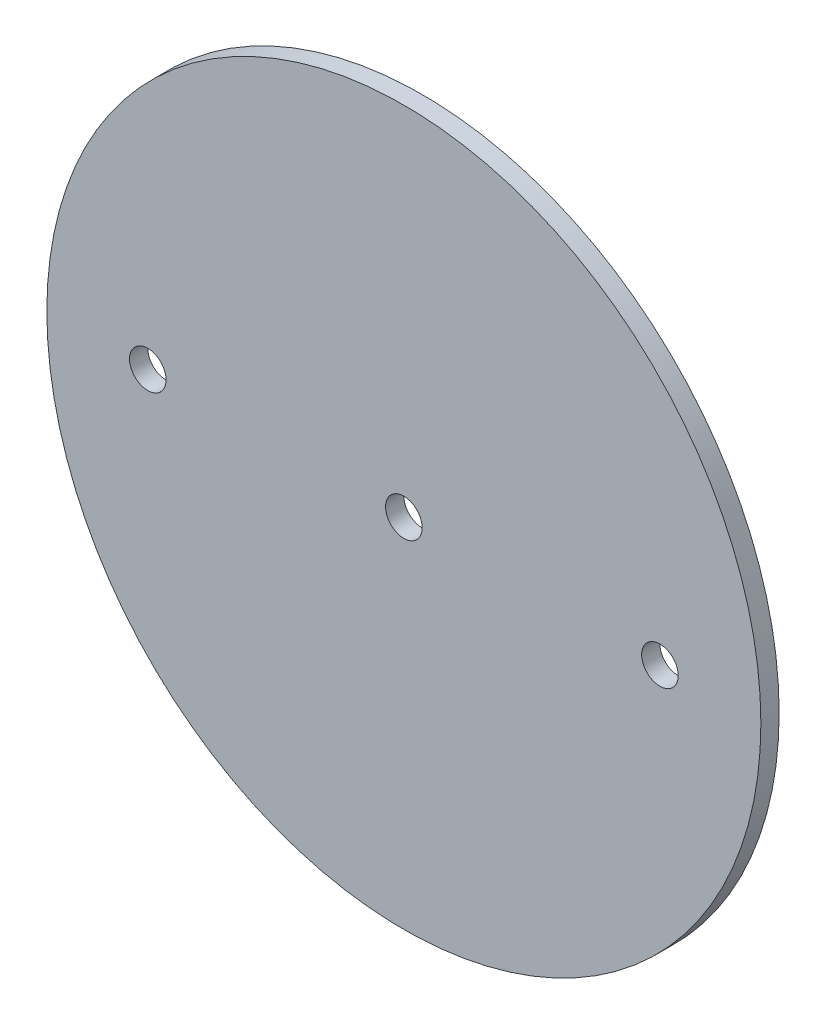
ISO-10303-21;
HEADER;
FILE_DESCRIPTION(('STEP AP214'),'2;1');
FILE_NAME('part.step','',(''),(''),'','','');
FILE_SCHEMA(('AUTOMOTIVE_DESIGN { 1 0 10303 214 1 1 1 1 }'));
ENDSEC;
DATA;
#1=APPLICATION_CONTEXT('core data for automotive mechanical design processes');
#2=APPLICATION_PROTOCOL_DEFINITION('international standard','automotive_design',2000,#1);
#3=PRODUCT_CONTEXT('',#1,'mechanical');
#4=PRODUCT('Part','Part','',(#3));
#5=PRODUCT_RELATED_PRODUCT_CATEGORY('part','',(#4));
#6=PRODUCT_DEFINITION_FORMATION('','',#4);
#7=PRODUCT_DEFINITION_CONTEXT('part definition',#1,'design');
#8=PRODUCT_DEFINITION('design','',#6,#7);
#9=PRODUCT_DEFINITION_SHAPE('','',#8);
#10=(LENGTH_UNIT() NAMED_UNIT(*) SI_UNIT(.MILLI.,.METRE.));
#11=(NAMED_UNIT(*) PLANE_ANGLE_UNIT() SI_UNIT($,.RADIAN.));
#12=(NAMED_UNIT(*) SI_UNIT($,.STERADIAN.) SOLID_ANGLE_UNIT());
#13=UNCERTAINTY_MEASURE_WITH_UNIT(LENGTH_MEASURE(1.E-05),#10,'distance_accuracy_value','');
#14=(GEOMETRIC_REPRESENTATION_CONTEXT(3) GLOBAL_UNCERTAINTY_ASSIGNED_CONTEXT((#13)) GLOBAL_UNIT_ASSIGNED_CONTEXT((#10,
#11,#12)) REPRESENTATION_CONTEXT('',''));
#15=CARTESIAN_POINT('',(0.,0.,0.));
#16=DIRECTION('',(0.,0.,1.));
#17=DIRECTION('',(1.,0.,0.));
#18=AXIS2_PLACEMENT_3D('',#15,#16,#17);
#19=CARTESIAN_POINT('',(0.,0.,1.5875));
#20=DIRECTION('',(0.,0.,-1.));
#21=DIRECTION('',(-1.,0.,0.));
#22=AXIS2_PLACEMENT_3D('',#19,#20,#21);
#23=CYLINDRICAL_SURFACE('',#22,61.976);
#24=CARTESIAN_POINT('',(0.,0.,1.5875));
#25=DIRECTION('',(0.,0.,1.));
#26=DIRECTION('',(1.,0.,0.));
#27=AXIS2_PLACEMENT_3D('',#24,#25,#26);
#28=CIRCLE('',#27,61.976);
#29=CARTESIAN_POINT('',(61.976,0.,1.5875));
#30=VERTEX_POINT('',#29);
#31=EDGE_CURVE('E10',#30,#30,#28,.T.);
#32=ORIENTED_EDGE('',*,*,#31,.F.);
#33=EDGE_LOOP('',(#32));
#34=FACE_BOUND('',#33,.T.);
#35=CARTESIAN_POINT('',(0.,0.,-1.5875));
#36=DIRECTION('',(0.,0.,1.));
#37=DIRECTION('',(1.,0.,0.));
#38=AXIS2_PLACEMENT_3D('',#35,#36,#37);
#39=CIRCLE('',#38,61.976);
#40=CARTESIAN_POINT('',(61.976,0.,-1.5875));
#41=VERTEX_POINT('',#40);
#42=EDGE_CURVE('E40',#41,#41,#39,.T.);
#43=ORIENTED_EDGE('',*,*,#42,.T.);
#44=EDGE_LOOP('',(#43));
#45=FACE_BOUND('',#44,.T.);
#46=ADVANCED_FACE('F37',(#34,#45),#23,.T.);
#47=CARTESIAN_POINT('',(0.,0.,1.5875));
#48=DIRECTION('',(0.,0.,1.));
#49=DIRECTION('',(1.,0.,0.));
#50=AXIS2_PLACEMENT_3D('',#47,#48,#49);
#51=PLANE('',#50);
#52=CARTESIAN_POINT('',(0.,0.,1.5875));
#53=DIRECTION('',(0.,0.,1.));
#54=DIRECTION('',(1.,0.,0.));
#55=AXIS2_PLACEMENT_3D('',#52,#53,#54);
#56=CIRCLE('',#55,3.17499999999999);
#57=CARTESIAN_POINT('',(3.17499999999999,0.,1.5875));
#58=VERTEX_POINT('',#57);
#59=EDGE_CURVE('E63',#58,#58,#56,.T.);
#60=ORIENTED_EDGE('',*,*,#59,.F.);
#61=EDGE_LOOP('',(#60));
#62=FACE_BOUND('',#61,.T.);
#63=CARTESIAN_POINT('',(44.45,0.,1.5875));
#64=DIRECTION('',(0.,0.,1.));
#65=DIRECTION('',(1.,0.,0.));
#66=AXIS2_PLACEMENT_3D('',#63,#64,#65);
#67=CIRCLE('',#66,3.17499999999998);
#68=CARTESIAN_POINT('',(47.625,0.,1.5875));
#69=VERTEX_POINT('',#68);
#70=EDGE_CURVE('E57',#69,#69,#67,.T.);
#71=ORIENTED_EDGE('',*,*,#70,.F.);
#72=EDGE_LOOP('',(#71));
#73=FACE_BOUND('',#72,.T.);
#74=CARTESIAN_POINT('',(-44.45,0.,1.5875));
#75=DIRECTION('',(0.,0.,1.));
#76=DIRECTION('',(1.,0.,0.));
#77=AXIS2_PLACEMENT_3D('',#74,#75,#76);
#78=CIRCLE('',#77,3.17499999999999);
#79=CARTESIAN_POINT('',(-41.275,0.,1.5875));
#80=VERTEX_POINT('',#79);
#81=EDGE_CURVE('E51',#80,#80,#78,.T.);
#82=ORIENTED_EDGE('',*,*,#81,.F.);
#83=EDGE_LOOP('',(#82));
#84=FACE_BOUND('',#83,.T.);
#85=ORIENTED_EDGE('',*,*,#31,.T.);
#86=EDGE_LOOP('',(#85));
#87=FACE_BOUND('',#86,.T.);
#88=ADVANCED_FACE('F69',(#62,#73,#84,#87),#51,.T.);
#89=CARTESIAN_POINT('',(0.,0.,-1.5875));
#90=DIRECTION('',(0.,0.,1.));
#91=DIRECTION('',(1.,0.,0.));
#92=AXIS2_PLACEMENT_3D('',#89,#90,#91);
#93=PLANE('',#92);
#94=CARTESIAN_POINT('',(0.,0.,-1.5875));
#95=DIRECTION('',(0.,0.,1.));
#96=DIRECTION('',(1.,0.,0.));
#97=AXIS2_PLACEMENT_3D('',#94,#95,#96);
#98=CIRCLE('',#97,3.17499999999999);
#99=CARTESIAN_POINT('',(3.17499999999999,0.,-1.5875));
#100=VERTEX_POINT('',#99);
#101=EDGE_CURVE('E60',#100,#100,#98,.T.);
#102=ORIENTED_EDGE('',*,*,#101,.T.);
#103=EDGE_LOOP('',(#102));
#104=FACE_BOUND('',#103,.T.);
#105=CARTESIAN_POINT('',(44.45,0.,-1.5875));
#106=DIRECTION('',(0.,0.,1.));
#107=DIRECTION('',(1.,0.,0.));
#108=AXIS2_PLACEMENT_3D('',#105,#106,#107);
#109=CIRCLE('',#108,3.17499999999999);
#110=CARTESIAN_POINT('',(47.625,0.,-1.5875));
#111=VERTEX_POINT('',#110);
#112=EDGE_CURVE('E54',#111,#111,#109,.T.);
#113=ORIENTED_EDGE('',*,*,#112,.T.);
#114=EDGE_LOOP('',(#113));
#115=FACE_BOUND('',#114,.T.);
#116=CARTESIAN_POINT('',(-44.45,0.,-1.5875));
#117=DIRECTION('',(0.,0.,1.));
#118=DIRECTION('',(1.,0.,0.));
#119=AXIS2_PLACEMENT_3D('',#116,#117,#118);
#120=CIRCLE('',#119,3.17499999999999);
#121=CARTESIAN_POINT('',(-41.275,0.,-1.5875));
#122=VERTEX_POINT('',#121);
#123=EDGE_CURVE('E47',#122,#122,#120,.T.);
#124=ORIENTED_EDGE('',*,*,#123,.T.);
#125=EDGE_LOOP('',(#124));
#126=FACE_BOUND('',#125,.T.);
#127=ORIENTED_EDGE('',*,*,#42,.F.);
#128=EDGE_LOOP('',(#127));
#129=FACE_BOUND('',#128,.T.);
#130=ADVANCED_FACE('F72',(#104,#115,#126,#129),#93,.F.);
#131=CARTESIAN_POINT('',(-44.45,0.,1.5875));
#132=DIRECTION('',(0.,0.,1.));
#133=DIRECTION('',(1.,0.,0.));
#134=AXIS2_PLACEMENT_3D('',#131,#132,#133);
#135=CYLINDRICAL_SURFACE('',#134,3.17499999999999);
#136=ORIENTED_EDGE('',*,*,#123,.F.);
#137=EDGE_LOOP('',(#136));
#138=FACE_BOUND('',#137,.T.);
#139=ORIENTED_EDGE('',*,*,#81,.T.);
#140=EDGE_LOOP('',(#139));
#141=FACE_BOUND('',#140,.T.);
#142=ADVANCED_FACE('F78',(#138,#141),#135,.F.);
#143=CARTESIAN_POINT('',(44.45,0.,1.5875));
#144=DIRECTION('',(0.,0.,1.));
#145=DIRECTION('',(1.,0.,0.));
#146=AXIS2_PLACEMENT_3D('',#143,#144,#145);
#147=CYLINDRICAL_SURFACE('',#146,3.17499999999999);
#148=ORIENTED_EDGE('',*,*,#112,.F.);
#149=EDGE_LOOP('',(#148));
#150=FACE_BOUND('',#149,.T.);
#151=ORIENTED_EDGE('',*,*,#70,.T.);
#152=EDGE_LOOP('',(#151));
#153=FACE_BOUND('',#152,.T.);
#154=ADVANCED_FACE('F80',(#150,#153),#147,.F.);
#155=CARTESIAN_POINT('',(0.,0.,1.5875));
#156=DIRECTION('',(0.,0.,1.));
#157=DIRECTION('',(1.,0.,0.));
#158=AXIS2_PLACEMENT_3D('',#155,#156,#157);
#159=CYLINDRICAL_SURFACE('',#158,3.17499999999999);
#160=ORIENTED_EDGE('',*,*,#101,.F.);
#161=EDGE_LOOP('',(#160));
#162=FACE_BOUND('',#161,.T.);
#163=ORIENTED_EDGE('',*,*,#59,.T.);
#164=EDGE_LOOP('',(#163));
#165=FACE_BOUND('',#164,.T.);
#166=ADVANCED_FACE('F67',(#162,#165),#159,.F.);
#167=CLOSED_SHELL('',(#46,#88,#130,#142,#154,#166));
#168=MANIFOLD_SOLID_BREP('B2',#167);
#169=ADVANCED_BREP_SHAPE_REPRESENTATION('',(#18,#168),#14);
#170=SHAPE_DEFINITION_REPRESENTATION(#9,#169);
ENDSEC;
END-ISO-10303-21;
